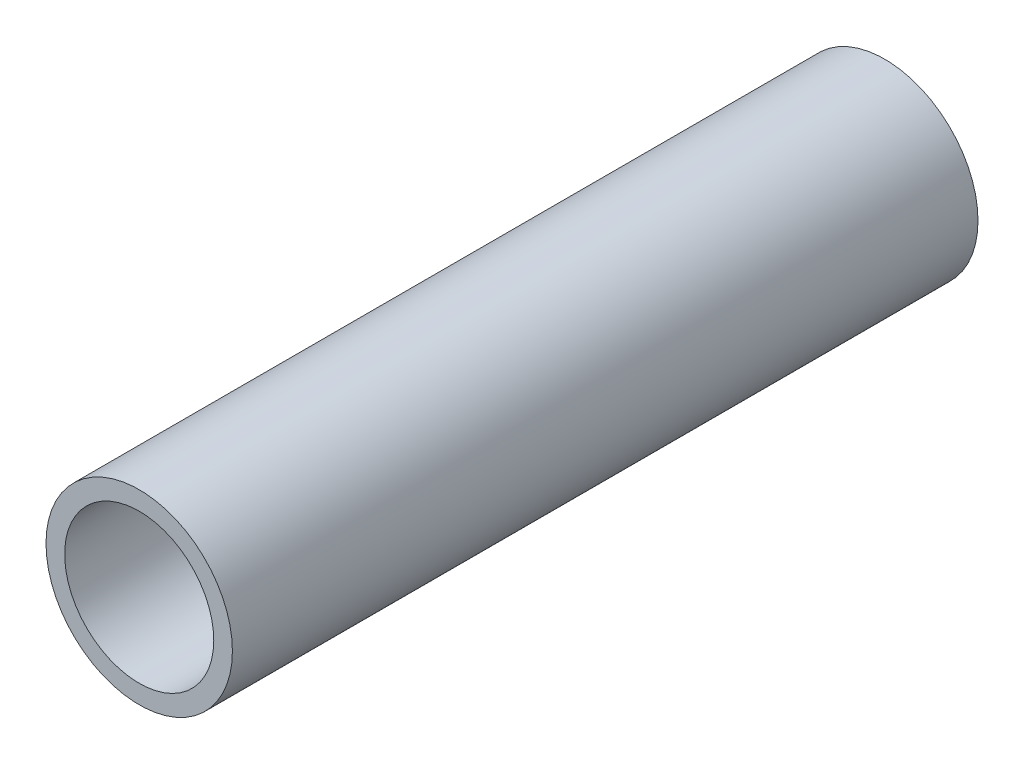
ISO-10303-21;
HEADER;
FILE_DESCRIPTION(('STEP AP214'),'2;1');
FILE_NAME('part.step','',(''),(''),'','','');
FILE_SCHEMA(('AUTOMOTIVE_DESIGN { 1 0 10303 214 1 1 1 1 }'));
ENDSEC;
DATA;
#1=APPLICATION_CONTEXT('core data for automotive mechanical design processes');
#2=APPLICATION_PROTOCOL_DEFINITION('international standard','automotive_design',2000,#1);
#3=PRODUCT_CONTEXT('',#1,'mechanical');
#4=PRODUCT('Part','Part','',(#3));
#5=PRODUCT_RELATED_PRODUCT_CATEGORY('part','',(#4));
#6=PRODUCT_DEFINITION_FORMATION('','',#4);
#7=PRODUCT_DEFINITION_CONTEXT('part definition',#1,'design');
#8=PRODUCT_DEFINITION('design','',#6,#7);
#9=PRODUCT_DEFINITION_SHAPE('','',#8);
#10=(LENGTH_UNIT() NAMED_UNIT(*) SI_UNIT(.MILLI.,.METRE.));
#11=(NAMED_UNIT(*) PLANE_ANGLE_UNIT() SI_UNIT($,.RADIAN.));
#12=(NAMED_UNIT(*) SI_UNIT($,.STERADIAN.) SOLID_ANGLE_UNIT());
#13=UNCERTAINTY_MEASURE_WITH_UNIT(LENGTH_MEASURE(1.E-05),#10,'distance_accuracy_value','');
#14=(GEOMETRIC_REPRESENTATION_CONTEXT(3) GLOBAL_UNCERTAINTY_ASSIGNED_CONTEXT((#13)) GLOBAL_UNIT_ASSIGNED_CONTEXT((#10,
#11,#12)) REPRESENTATION_CONTEXT('',''));
#15=CARTESIAN_POINT('',(0.,0.,0.));
#16=DIRECTION('',(0.,0.,1.));
#17=DIRECTION('',(1.,0.,0.));
#18=AXIS2_PLACEMENT_3D('',#15,#16,#17);
#19=CARTESIAN_POINT('',(0.,0.,20.));
#20=DIRECTION('',(0.,0.,1.));
#21=DIRECTION('',(1.,0.,0.));
#22=AXIS2_PLACEMENT_3D('',#19,#20,#21);
#23=PLANE('',#22);
#24=CARTESIAN_POINT('',(0.,0.,20.));
#25=DIRECTION('',(0.,0.,1.));
#26=DIRECTION('',(1.,0.,0.));
#27=AXIS2_PLACEMENT_3D('',#24,#25,#26);
#28=CIRCLE('',#27,2.5);
#29=CARTESIAN_POINT('',(2.5,0.,20.));
#30=VERTEX_POINT('',#29);
#31=EDGE_CURVE('E11',#30,#30,#28,.T.);
#32=ORIENTED_EDGE('',*,*,#31,.T.);
#33=EDGE_LOOP('',(#32));
#34=FACE_BOUND('',#33,.T.);
#35=CARTESIAN_POINT('',(0.,0.,20.));
#36=DIRECTION('',(0.,0.,1.));
#37=DIRECTION('',(1.,0.,0.));
#38=AXIS2_PLACEMENT_3D('',#35,#36,#37);
#39=CIRCLE('',#38,2.);
#40=CARTESIAN_POINT('',(2.,0.,20.));
#41=VERTEX_POINT('',#40);
#42=EDGE_CURVE('E48',#41,#41,#39,.T.);
#43=ORIENTED_EDGE('',*,*,#42,.F.);
#44=EDGE_LOOP('',(#43));
#45=FACE_BOUND('',#44,.T.);
#46=ADVANCED_FACE('F37',(#34,#45),#23,.T.);
#47=CARTESIAN_POINT('',(0.,0.,0.));
#48=DIRECTION('',(0.,0.,1.));
#49=DIRECTION('',(1.,0.,0.));
#50=AXIS2_PLACEMENT_3D('',#47,#48,#49);
#51=PLANE('',#50);
#52=CARTESIAN_POINT('',(0.,0.,0.));
#53=DIRECTION('',(0.,0.,1.));
#54=DIRECTION('',(1.,0.,0.));
#55=AXIS2_PLACEMENT_3D('',#52,#53,#54);
#56=CIRCLE('',#55,2.5);
#57=CARTESIAN_POINT('',(2.5,0.,0.));
#58=VERTEX_POINT('',#57);
#59=EDGE_CURVE('E41',#58,#58,#56,.T.);
#60=ORIENTED_EDGE('',*,*,#59,.F.);
#61=EDGE_LOOP('',(#60));
#62=FACE_BOUND('',#61,.T.);
#63=CARTESIAN_POINT('',(0.,0.,0.));
#64=DIRECTION('',(0.,0.,1.));
#65=DIRECTION('',(1.,0.,0.));
#66=AXIS2_PLACEMENT_3D('',#63,#64,#65);
#67=CIRCLE('',#66,2.);
#68=CARTESIAN_POINT('',(2.,0.,0.));
#69=VERTEX_POINT('',#68);
#70=EDGE_CURVE('E50',#69,#69,#67,.T.);
#71=ORIENTED_EDGE('',*,*,#70,.T.);
#72=EDGE_LOOP('',(#71));
#73=FACE_BOUND('',#72,.T.);
#74=ADVANCED_FACE('F60',(#62,#73),#51,.F.);
#75=CARTESIAN_POINT('',(0.,0.,20.));
#76=DIRECTION('',(0.,0.,-1.));
#77=DIRECTION('',(-1.,0.,0.));
#78=AXIS2_PLACEMENT_3D('',#75,#76,#77);
#79=CYLINDRICAL_SURFACE('',#78,2.5);
#80=ORIENTED_EDGE('',*,*,#31,.F.);
#81=EDGE_LOOP('',(#80));
#82=FACE_BOUND('',#81,.T.);
#83=ORIENTED_EDGE('',*,*,#59,.T.);
#84=EDGE_LOOP('',(#83));
#85=FACE_BOUND('',#84,.T.);
#86=ADVANCED_FACE('F39',(#82,#85),#79,.T.);
#87=CARTESIAN_POINT('',(0.,0.,20.));
#88=DIRECTION('',(0.,0.,-1.));
#89=DIRECTION('',(-1.,0.,0.));
#90=AXIS2_PLACEMENT_3D('',#87,#88,#89);
#91=CYLINDRICAL_SURFACE('',#90,2.);
#92=ORIENTED_EDGE('',*,*,#42,.T.);
#93=EDGE_LOOP('',(#92));
#94=FACE_BOUND('',#93,.T.);
#95=ORIENTED_EDGE('',*,*,#70,.F.);
#96=EDGE_LOOP('',(#95));
#97=FACE_BOUND('',#96,.T.);
#98=ADVANCED_FACE('F56',(#94,#97),#91,.F.);
#99=CLOSED_SHELL('',(#46,#74,#86,#98));
#100=MANIFOLD_SOLID_BREP('B2',#99);
#101=ADVANCED_BREP_SHAPE_REPRESENTATION('',(#18,#100),#14);
#102=SHAPE_DEFINITION_REPRESENTATION(#9,#101);
ENDSEC;
END-ISO-10303-21;
